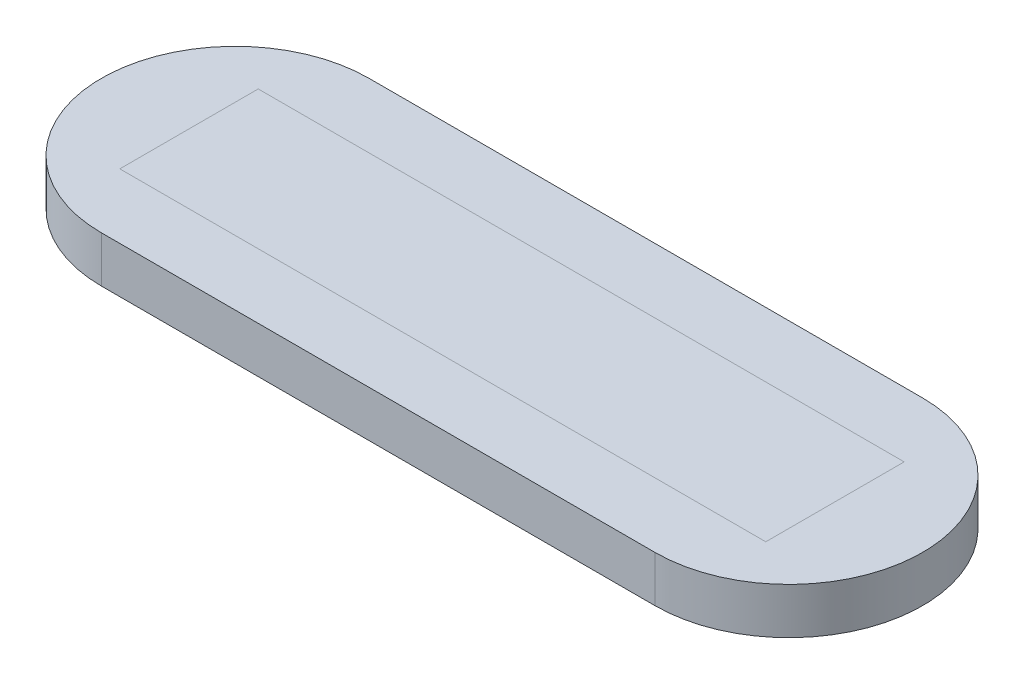
ISO-10303-21;
HEADER;
FILE_DESCRIPTION(('STEP AP214'),'2;1');
FILE_NAME('part.step','',(''),(''),'','','');
FILE_SCHEMA(('AUTOMOTIVE_DESIGN { 1 0 10303 214 1 1 1 1 }'));
ENDSEC;
DATA;
#1=APPLICATION_CONTEXT('core data for automotive mechanical design processes');
#2=APPLICATION_PROTOCOL_DEFINITION('international standard','automotive_design',2000,#1);
#3=PRODUCT_CONTEXT('',#1,'mechanical');
#4=PRODUCT('Part','Part','',(#3));
#5=PRODUCT_RELATED_PRODUCT_CATEGORY('part','',(#4));
#6=PRODUCT_DEFINITION_FORMATION('','',#4);
#7=PRODUCT_DEFINITION_CONTEXT('part definition',#1,'design');
#8=PRODUCT_DEFINITION('design','',#6,#7);
#9=PRODUCT_DEFINITION_SHAPE('','',#8);
#10=(LENGTH_UNIT() NAMED_UNIT(*) SI_UNIT(.MILLI.,.METRE.));
#11=(NAMED_UNIT(*) PLANE_ANGLE_UNIT() SI_UNIT($,.RADIAN.));
#12=(NAMED_UNIT(*) SI_UNIT($,.STERADIAN.) SOLID_ANGLE_UNIT());
#13=UNCERTAINTY_MEASURE_WITH_UNIT(LENGTH_MEASURE(1.E-05),#10,'distance_accuracy_value','');
#14=(GEOMETRIC_REPRESENTATION_CONTEXT(3) GLOBAL_UNCERTAINTY_ASSIGNED_CONTEXT((#13)) GLOBAL_UNIT_ASSIGNED_CONTEXT((#10,
#11,#12)) REPRESENTATION_CONTEXT('',''));
#15=CARTESIAN_POINT('',(0.,0.,0.));
#16=DIRECTION('',(0.,0.,1.));
#17=DIRECTION('',(1.,0.,0.));
#18=AXIS2_PLACEMENT_3D('',#15,#16,#17);
#19=CARTESIAN_POINT('',(-3.,0.5,0.));
#20=DIRECTION('',(0.,1.,0.));
#21=DIRECTION('',(0.,0.,1.));
#22=AXIS2_PLACEMENT_3D('',#19,#20,#21);
#23=PLANE('',#22);
#24=DIRECTION('',(1.,0.,0.));
#25=VECTOR('',#24,1.);
#26=CARTESIAN_POINT('',(-3.5,0.5,0.75));
#27=LINE('',#26,#25);
#28=CARTESIAN_POINT('',(-3.5,0.5,0.75));
#29=VERTEX_POINT('',#28);
#30=CARTESIAN_POINT('',(3.5,0.5,0.75));
#31=VERTEX_POINT('',#30);
#32=EDGE_CURVE('E284',#29,#31,#27,.T.);
#33=ORIENTED_EDGE('',*,*,#32,.T.);
#34=DIRECTION('',(0.,0.,-1.));
#35=VECTOR('',#34,1.);
#36=CARTESIAN_POINT('',(3.5,0.5,0.75));
#37=LINE('',#36,#35);
#38=CARTESIAN_POINT('',(3.5,0.5,-0.75));
#39=VERTEX_POINT('',#38);
#40=EDGE_CURVE('E15',#31,#39,#37,.T.);
#41=ORIENTED_EDGE('',*,*,#40,.T.);
#42=DIRECTION('',(-1.,0.,0.));
#43=VECTOR('',#42,1.);
#44=CARTESIAN_POINT('',(-3.5,0.5,-0.75));
#45=LINE('',#44,#43);
#46=CARTESIAN_POINT('',(-3.5,0.5,-0.75));
#47=VERTEX_POINT('',#46);
#48=EDGE_CURVE('E220',#39,#47,#45,.T.);
#49=ORIENTED_EDGE('',*,*,#48,.T.);
#50=DIRECTION('',(0.,0.,1.));
#51=VECTOR('',#50,1.);
#52=CARTESIAN_POINT('',(-3.5,0.5,0.75));
#53=LINE('',#52,#51);
#54=EDGE_CURVE('E287',#47,#29,#53,.T.);
#55=ORIENTED_EDGE('',*,*,#54,.T.);
#56=EDGE_LOOP('',(#33,#41,#49,#55));
#57=FACE_BOUND('',#56,.T.);
#58=ADVANCED_FACE('F211',(#57),#23,.T.);
#59=CARTESIAN_POINT('',(-3.,0.5,0.));
#60=DIRECTION('',(0.,-1.,0.));
#61=DIRECTION('',(0.,0.,-1.));
#62=AXIS2_PLACEMENT_3D('',#59,#60,#61);
#63=CYLINDRICAL_SURFACE('',#62,1.45);
#64=CARTESIAN_POINT('',(-3.,0.,0.));
#65=DIRECTION('',(0.,1.,0.));
#66=DIRECTION('',(0.,0.,1.));
#67=AXIS2_PLACEMENT_3D('',#64,#65,#66);
#68=CIRCLE('',#67,1.45);
#69=CARTESIAN_POINT('',(-3.,0.,-1.45));
#70=VERTEX_POINT('',#69);
#71=CARTESIAN_POINT('',(-3.,0.,1.45));
#72=VERTEX_POINT('',#71);
#73=EDGE_CURVE('E283',#70,#72,#68,.T.);
#74=ORIENTED_EDGE('',*,*,#73,.T.);
#75=DIRECTION('',(0.,-1.,0.));
#76=VECTOR('',#75,1.);
#77=CARTESIAN_POINT('',(-3.,0.5,1.45));
#78=LINE('',#77,#76);
#79=CARTESIAN_POINT('',(-3.,0.5,1.45));
#80=VERTEX_POINT('',#79);
#81=EDGE_CURVE('E264',#80,#72,#78,.T.);
#82=ORIENTED_EDGE('',*,*,#81,.F.);
#83=CARTESIAN_POINT('',(-3.,0.5,0.));
#84=DIRECTION('',(0.,1.,0.));
#85=DIRECTION('',(0.,0.,1.));
#86=AXIS2_PLACEMENT_3D('',#83,#84,#85);
#87=CIRCLE('',#86,1.45);
#88=CARTESIAN_POINT('',(-3.,0.5,-1.45));
#89=VERTEX_POINT('',#88);
#90=EDGE_CURVE('E271',#89,#80,#87,.T.);
#91=ORIENTED_EDGE('',*,*,#90,.F.);
#92=DIRECTION('',(0.,-1.,0.));
#93=VECTOR('',#92,1.);
#94=CARTESIAN_POINT('',(-3.,0.5,-1.45));
#95=LINE('',#94,#93);
#96=EDGE_CURVE('E339',#89,#70,#95,.T.);
#97=ORIENTED_EDGE('',*,*,#96,.T.);
#98=EDGE_LOOP('',(#74,#82,#91,#97));
#99=FACE_BOUND('',#98,.T.);
#100=ADVANCED_FACE('F213',(#99),#63,.T.);
#101=CARTESIAN_POINT('',(-3.,0.5,1.45));
#102=DIRECTION('',(0.,0.,-1.));
#103=DIRECTION('',(-1.,0.,0.));
#104=AXIS2_PLACEMENT_3D('',#101,#102,#103);
#105=PLANE('',#104);
#106=DIRECTION('',(1.,0.,0.));
#107=VECTOR('',#106,1.);
#108=CARTESIAN_POINT('',(-3.,0.,1.45));
#109=LINE('',#108,#107);
#110=CARTESIAN_POINT('',(3.,0.,1.45));
#111=VERTEX_POINT('',#110);
#112=EDGE_CURVE('E337',#72,#111,#109,.T.);
#113=ORIENTED_EDGE('',*,*,#112,.T.);
#114=DIRECTION('',(0.,-1.,0.));
#115=VECTOR('',#114,1.);
#116=CARTESIAN_POINT('',(3.,0.5,1.45));
#117=LINE('',#116,#115);
#118=CARTESIAN_POINT('',(3.,0.5,1.45));
#119=VERTEX_POINT('',#118);
#120=EDGE_CURVE('E267',#119,#111,#117,.T.);
#121=ORIENTED_EDGE('',*,*,#120,.F.);
#122=DIRECTION('',(1.,0.,0.));
#123=VECTOR('',#122,1.);
#124=CARTESIAN_POINT('',(-3.,0.5,1.45));
#125=LINE('',#124,#123);
#126=EDGE_CURVE('E260',#80,#119,#125,.T.);
#127=ORIENTED_EDGE('',*,*,#126,.F.);
#128=ORIENTED_EDGE('',*,*,#81,.T.);
#129=EDGE_LOOP('',(#113,#121,#127,#128));
#130=FACE_BOUND('',#129,.T.);
#131=ADVANCED_FACE('F262',(#130),#105,.F.);
#132=CARTESIAN_POINT('',(3.,0.5,0.));
#133=DIRECTION('',(0.,-1.,0.));
#134=DIRECTION('',(0.,0.,-1.));
#135=AXIS2_PLACEMENT_3D('',#132,#133,#134);
#136=CYLINDRICAL_SURFACE('',#135,1.45);
#137=CARTESIAN_POINT('',(3.,0.,0.));
#138=DIRECTION('',(0.,1.,0.));
#139=DIRECTION('',(0.,0.,1.));
#140=AXIS2_PLACEMENT_3D('',#137,#138,#139);
#141=CIRCLE('',#140,1.45);
#142=CARTESIAN_POINT('',(3.,0.,-1.45));
#143=VERTEX_POINT('',#142);
#144=EDGE_CURVE('E334',#111,#143,#141,.T.);
#145=ORIENTED_EDGE('',*,*,#144,.T.);
#146=DIRECTION('',(0.,-1.,0.));
#147=VECTOR('',#146,1.);
#148=CARTESIAN_POINT('',(3.,0.5,-1.45));
#149=LINE('',#148,#147);
#150=CARTESIAN_POINT('',(3.,0.5,-1.45));
#151=VERTEX_POINT('',#150);
#152=EDGE_CURVE('E289',#151,#143,#149,.T.);
#153=ORIENTED_EDGE('',*,*,#152,.F.);
#154=CARTESIAN_POINT('',(3.,0.5,0.));
#155=DIRECTION('',(0.,1.,0.));
#156=DIRECTION('',(0.,0.,1.));
#157=AXIS2_PLACEMENT_3D('',#154,#155,#156);
#158=CIRCLE('',#157,1.45);
#159=EDGE_CURVE('E270',#119,#151,#158,.T.);
#160=ORIENTED_EDGE('',*,*,#159,.F.);
#161=ORIENTED_EDGE('',*,*,#120,.T.);
#162=EDGE_LOOP('',(#145,#153,#160,#161));
#163=FACE_BOUND('',#162,.T.);
#164=ADVANCED_FACE('F315',(#163),#136,.T.);
#165=CARTESIAN_POINT('',(-3.,0.5,-1.45));
#166=DIRECTION('',(0.,0.,1.));
#167=DIRECTION('',(1.,0.,0.));
#168=AXIS2_PLACEMENT_3D('',#165,#166,#167);
#169=PLANE('',#168);
#170=DIRECTION('',(-1.,0.,0.));
#171=VECTOR('',#170,1.);
#172=CARTESIAN_POINT('',(-3.,0.,-1.45));
#173=LINE('',#172,#171);
#174=EDGE_CURVE('E280',#143,#70,#173,.T.);
#175=ORIENTED_EDGE('',*,*,#174,.T.);
#176=ORIENTED_EDGE('',*,*,#96,.F.);
#177=DIRECTION('',(-1.,0.,0.));
#178=VECTOR('',#177,1.);
#179=CARTESIAN_POINT('',(-3.,0.5,-1.45));
#180=LINE('',#179,#178);
#181=EDGE_CURVE('E276',#151,#89,#180,.T.);
#182=ORIENTED_EDGE('',*,*,#181,.F.);
#183=ORIENTED_EDGE('',*,*,#152,.T.);
#184=EDGE_LOOP('',(#175,#176,#182,#183));
#185=FACE_BOUND('',#184,.T.);
#186=ADVANCED_FACE('F307',(#185),#169,.F.);
#187=ORIENTED_EDGE('',*,*,#40,.F.);
#188=ORIENTED_EDGE('',*,*,#32,.F.);
#189=ORIENTED_EDGE('',*,*,#54,.F.);
#190=ORIENTED_EDGE('',*,*,#48,.F.);
#191=EDGE_LOOP('',(#187,#188,#189,#190));
#192=FACE_BOUND('',#191,.T.);
#193=ORIENTED_EDGE('',*,*,#90,.T.);
#194=ORIENTED_EDGE('',*,*,#126,.T.);
#195=ORIENTED_EDGE('',*,*,#159,.T.);
#196=ORIENTED_EDGE('',*,*,#181,.T.);
#197=EDGE_LOOP('',(#193,#194,#195,#196));
#198=FACE_BOUND('',#197,.T.);
#199=ADVANCED_FACE('F274',(#192,#198),#23,.T.);
#200=CARTESIAN_POINT('',(-3.,0.,0.));
#201=DIRECTION('',(0.,1.,0.));
#202=DIRECTION('',(0.,0.,1.));
#203=AXIS2_PLACEMENT_3D('',#200,#201,#202);
#204=PLANE('',#203);
#205=ORIENTED_EDGE('',*,*,#73,.F.);
#206=ORIENTED_EDGE('',*,*,#174,.F.);
#207=ORIENTED_EDGE('',*,*,#144,.F.);
#208=ORIENTED_EDGE('',*,*,#112,.F.);
#209=EDGE_LOOP('',(#205,#206,#207,#208));
#210=FACE_BOUND('',#209,.T.);
#211=ADVANCED_FACE('F306',(#210),#204,.F.);
#212=CLOSED_SHELL('',(#58,#100,#131,#164,#186,#199,#211));
#213=MANIFOLD_SOLID_BREP('B2',#212);
#214=ADVANCED_BREP_SHAPE_REPRESENTATION('',(#18,#213),#14);
#215=SHAPE_DEFINITION_REPRESENTATION(#9,#214);
ENDSEC;
END-ISO-10303-21;
